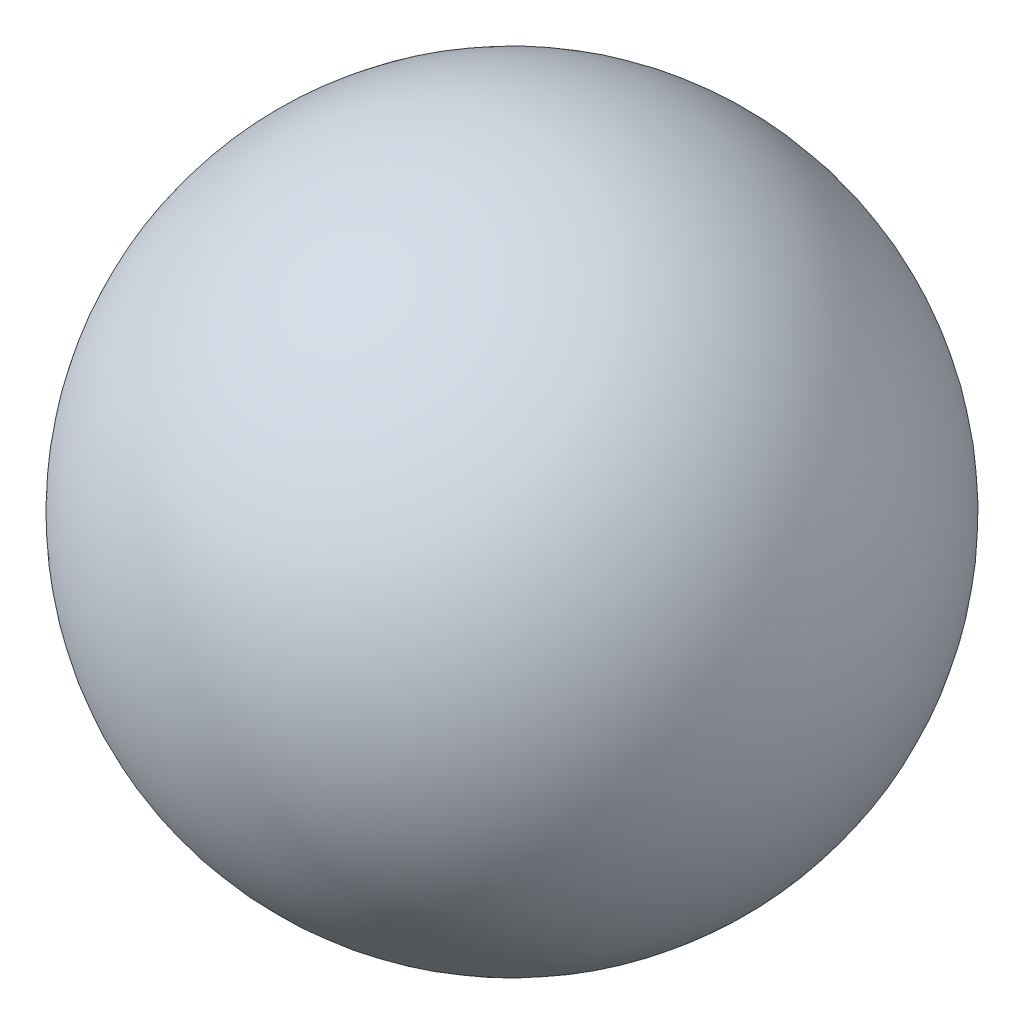
ISO-10303-21;
HEADER;
FILE_DESCRIPTION(('STEP AP214'),'2;1');
FILE_NAME('part.step','',(''),(''),'','','');
FILE_SCHEMA(('AUTOMOTIVE_DESIGN { 1 0 10303 214 1 1 1 1 }'));
ENDSEC;
DATA;
#1=APPLICATION_CONTEXT('core data for automotive mechanical design processes');
#2=APPLICATION_PROTOCOL_DEFINITION('international standard','automotive_design',2000,#1);
#3=PRODUCT_CONTEXT('',#1,'mechanical');
#4=PRODUCT('Part','Part','',(#3));
#5=PRODUCT_RELATED_PRODUCT_CATEGORY('part','',(#4));
#6=PRODUCT_DEFINITION_FORMATION('','',#4);
#7=PRODUCT_DEFINITION_CONTEXT('part definition',#1,'design');
#8=PRODUCT_DEFINITION('design','',#6,#7);
#9=PRODUCT_DEFINITION_SHAPE('','',#8);
#10=(LENGTH_UNIT() NAMED_UNIT(*) SI_UNIT(.MILLI.,.METRE.));
#11=(NAMED_UNIT(*) PLANE_ANGLE_UNIT() SI_UNIT($,.RADIAN.));
#12=(NAMED_UNIT(*) SI_UNIT($,.STERADIAN.) SOLID_ANGLE_UNIT());
#13=UNCERTAINTY_MEASURE_WITH_UNIT(LENGTH_MEASURE(1.E-05),#10,'distance_accuracy_value','');
#14=(GEOMETRIC_REPRESENTATION_CONTEXT(3) GLOBAL_UNCERTAINTY_ASSIGNED_CONTEXT((#13)) GLOBAL_UNIT_ASSIGNED_CONTEXT((#10,
#11,#12)) REPRESENTATION_CONTEXT('',''));
#15=CARTESIAN_POINT('',(0.,0.,0.));
#16=DIRECTION('',(0.,0.,1.));
#17=DIRECTION('',(1.,0.,0.));
#18=AXIS2_PLACEMENT_3D('',#15,#16,#17);
#19=CARTESIAN_POINT('',(64.16,-61.3232373551759,-32.4570677862432));
#20=DIRECTION('',(0.,-0.883836636570577,-0.467795681741105));
#21=DIRECTION('',(0.173648177666934,0.460688814204267,-0.87040917209093));
#22=AXIS2_PLACEMENT_3D('',#19,#20,#21);
#23=SPHERICAL_SURFACE('',#22,7.15);
#24=CARTESIAN_POINT('',(64.16,-55.0038054036962,-29.1123286617942));
#25=VERTEX_POINT('',#24);
#26=VERTEX_LOOP('',#25);
#27=FACE_BOUND('',#26,.T.);
#28=CARTESIAN_POINT('',(64.16,-67.6426693066554,-35.801806910692));
#29=VERTEX_POINT('',#28);
#30=VERTEX_LOOP('',#29);
#31=FACE_BOUND('',#30,.T.);
#32=ADVANCED_FACE('F15',(#27,#31),#23,.T.);
#33=CLOSED_SHELL('',(#32));
#34=MANIFOLD_SOLID_BREP('B1',#33);
#35=ADVANCED_BREP_SHAPE_REPRESENTATION('',(#18,#34),#14);
#36=SHAPE_DEFINITION_REPRESENTATION(#9,#35);
ENDSEC;
END-ISO-10303-21;
